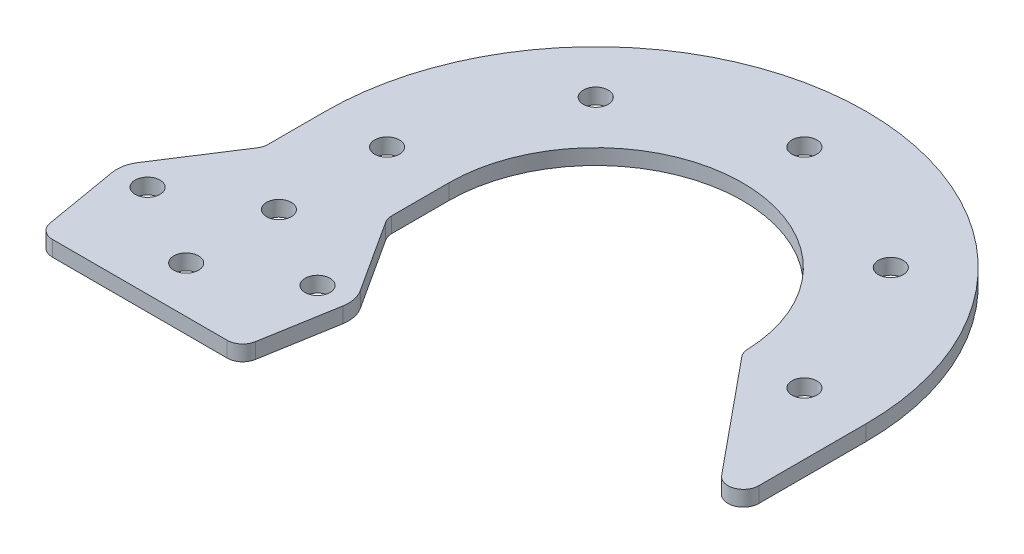
ISO-10303-21;
HEADER;
FILE_DESCRIPTION(('STEP AP214'),'2;1');
FILE_NAME('part.step','',(''),(''),'','','');
FILE_SCHEMA(('AUTOMOTIVE_DESIGN { 1 0 10303 214 1 1 1 1 }'));
ENDSEC;
DATA;
#1=APPLICATION_CONTEXT('core data for automotive mechanical design processes');
#2=APPLICATION_PROTOCOL_DEFINITION('international standard','automotive_design',2000,#1);
#3=PRODUCT_CONTEXT('',#1,'mechanical');
#4=PRODUCT('Part','Part','',(#3));
#5=PRODUCT_RELATED_PRODUCT_CATEGORY('part','',(#4));
#6=PRODUCT_DEFINITION_FORMATION('','',#4);
#7=PRODUCT_DEFINITION_CONTEXT('part definition',#1,'design');
#8=PRODUCT_DEFINITION('design','',#6,#7);
#9=PRODUCT_DEFINITION_SHAPE('','',#8);
#10=(LENGTH_UNIT() NAMED_UNIT(*) SI_UNIT(.MILLI.,.METRE.));
#11=(NAMED_UNIT(*) PLANE_ANGLE_UNIT() SI_UNIT($,.RADIAN.));
#12=(NAMED_UNIT(*) SI_UNIT($,.STERADIAN.) SOLID_ANGLE_UNIT());
#13=UNCERTAINTY_MEASURE_WITH_UNIT(LENGTH_MEASURE(1.E-05),#10,'distance_accuracy_value','');
#14=(GEOMETRIC_REPRESENTATION_CONTEXT(3) GLOBAL_UNCERTAINTY_ASSIGNED_CONTEXT((#13)) GLOBAL_UNIT_ASSIGNED_CONTEXT((#10,
#11,#12)) REPRESENTATION_CONTEXT('',''));
#15=CARTESIAN_POINT('',(0.,0.,0.));
#16=DIRECTION('',(0.,0.,1.));
#17=DIRECTION('',(1.,0.,0.));
#18=AXIS2_PLACEMENT_3D('',#15,#16,#17);
#19=CARTESIAN_POINT('',(88.8797617905169,3.175,-51.9614529831907));
#20=DIRECTION('',(0.,-1.,0.));
#21=DIRECTION('',(0.,0.,-1.));
#22=AXIS2_PLACEMENT_3D('',#19,#20,#21);
#23=CYLINDRICAL_SURFACE('',#22,3.175);
#24=CARTESIAN_POINT('',(88.8797617905169,3.175,-51.9614529831907));
#25=DIRECTION('',(0.,1.,0.));
#26=DIRECTION('',(0.,0.,1.));
#27=AXIS2_PLACEMENT_3D('',#24,#25,#26);
#28=CIRCLE('',#27,3.175);
#29=CARTESIAN_POINT('',(85.7066892390391,3.175,-51.8508384133629));
#30=VERTEX_POINT('',#29);
#31=CARTESIAN_POINT('',(86.4263326946628,3.175,-49.9461836037733));
#32=VERTEX_POINT('',#31);
#33=EDGE_CURVE('E308',#30,#32,#28,.T.);
#34=ORIENTED_EDGE('',*,*,#33,.F.);
#35=DIRECTION('',(0.,1.,0.));
#36=VECTOR('',#35,1.);
#37=CARTESIAN_POINT('',(85.7066892390391,3.175,-51.8508384133629));
#38=LINE('',#37,#36);
#39=CARTESIAN_POINT('',(85.7066892390391,0.,-51.8508384133629));
#40=VERTEX_POINT('',#39);
#41=EDGE_CURVE('E523',#40,#30,#38,.T.);
#42=ORIENTED_EDGE('',*,*,#41,.F.);
#43=CARTESIAN_POINT('',(88.8797617905169,0.,-51.9614529831907));
#44=DIRECTION('',(0.,-1.,0.));
#45=DIRECTION('',(0.,0.,1.));
#46=AXIS2_PLACEMENT_3D('',#43,#44,#45);
#47=CIRCLE('',#46,3.175);
#48=CARTESIAN_POINT('',(86.4263326946628,0.,-49.9461836037733));
#49=VERTEX_POINT('',#48);
#50=EDGE_CURVE('E425',#49,#40,#47,.T.);
#51=ORIENTED_EDGE('',*,*,#50,.F.);
#52=DIRECTION('',(0.,-1.,0.));
#53=VECTOR('',#52,1.);
#54=CARTESIAN_POINT('',(86.4263326946628,3.175,-49.9461836037733));
#55=LINE('',#54,#53);
#56=EDGE_CURVE('E451',#32,#49,#55,.T.);
#57=ORIENTED_EDGE('',*,*,#56,.F.);
#58=EDGE_LOOP('',(#34,#42,#51,#57));
#59=FACE_BOUND('',#58,.T.);
#60=ADVANCED_FACE('F17',(#59),#23,.T.);
#61=CARTESIAN_POINT('',(107.95,3.175,-28.7449650208988));
#62=DIRECTION('',(0.,-1.,0.));
#63=DIRECTION('',(0.,0.,-1.));
#64=AXIS2_PLACEMENT_3D('',#61,#62,#63);
#65=CYLINDRICAL_SURFACE('',#64,3.175);
#66=CARTESIAN_POINT('',(107.95,3.175,-28.7449650208988));
#67=DIRECTION('',(0.,1.,0.));
#68=DIRECTION('',(0.,0.,1.));
#69=AXIS2_PLACEMENT_3D('',#66,#67,#68);
#70=CIRCLE('',#69,3.175);
#71=CARTESIAN_POINT('',(105.496570904146,3.175,-26.7296956414817));
#72=VERTEX_POINT('',#71);
#73=CARTESIAN_POINT('',(111.125,3.175,-28.7449650208988));
#74=VERTEX_POINT('',#73);
#75=EDGE_CURVE('E307',#72,#74,#70,.T.);
#76=ORIENTED_EDGE('',*,*,#75,.F.);
#77=DIRECTION('',(0.,1.,0.));
#78=VECTOR('',#77,1.);
#79=CARTESIAN_POINT('',(105.496570904146,3.175,-26.7296956414817));
#80=LINE('',#79,#78);
#81=CARTESIAN_POINT('',(105.496570904146,0.,-26.7296956414817));
#82=VERTEX_POINT('',#81);
#83=EDGE_CURVE('E455',#82,#72,#80,.T.);
#84=ORIENTED_EDGE('',*,*,#83,.F.);
#85=CARTESIAN_POINT('',(107.95,0.,-28.7449650208988));
#86=DIRECTION('',(0.,-1.,0.));
#87=DIRECTION('',(0.,0.,1.));
#88=AXIS2_PLACEMENT_3D('',#85,#86,#87);
#89=CIRCLE('',#88,3.175);
#90=CARTESIAN_POINT('',(111.125,0.,-28.7449650208988));
#91=VERTEX_POINT('',#90);
#92=EDGE_CURVE('E331',#91,#82,#89,.T.);
#93=ORIENTED_EDGE('',*,*,#92,.F.);
#94=DIRECTION('',(0.,-1.,0.));
#95=VECTOR('',#94,1.);
#96=CARTESIAN_POINT('',(111.125,3.175,-28.7449650208988));
#97=LINE('',#96,#95);
#98=EDGE_CURVE('E454',#74,#91,#97,.T.);
#99=ORIENTED_EDGE('',*,*,#98,.F.);
#100=EDGE_LOOP('',(#76,#84,#93,#99));
#101=FACE_BOUND('',#100,.T.);
#102=ADVANCED_FACE('F19',(#101),#65,.T.);
#103=CARTESIAN_POINT('',(28.575,3.175,-39.037577783465));
#104=DIRECTION('',(0.,1.,0.));
#105=DIRECTION('',(0.,0.,1.));
#106=AXIS2_PLACEMENT_3D('',#103,#104,#105);
#107=CYLINDRICAL_SURFACE('',#106,3.175);
#108=CARTESIAN_POINT('',(28.575,3.175,-39.037577783465));
#109=DIRECTION('',(0.,-1.,0.));
#110=DIRECTION('',(0.,0.,1.));
#111=AXIS2_PLACEMENT_3D('',#108,#109,#110);
#112=CIRCLE('',#111,3.175);
#113=CARTESIAN_POINT('',(25.9093198261541,3.175,-37.3128244066703));
#114=VERTEX_POINT('',#113);
#115=CARTESIAN_POINT('',(25.4,3.175,-39.037577783465));
#116=VERTEX_POINT('',#115);
#117=EDGE_CURVE('E330',#114,#116,#112,.T.);
#118=ORIENTED_EDGE('',*,*,#117,.F.);
#119=DIRECTION('',(0.,1.,0.));
#120=VECTOR('',#119,1.);
#121=CARTESIAN_POINT('',(25.9093198261541,3.175,-37.3128244066703));
#122=LINE('',#121,#120);
#123=CARTESIAN_POINT('',(25.9093198261541,0.,-37.3128244066703));
#124=VERTEX_POINT('',#123);
#125=EDGE_CURVE('E415',#124,#114,#122,.T.);
#126=ORIENTED_EDGE('',*,*,#125,.F.);
#127=CARTESIAN_POINT('',(28.575,0.,-39.037577783465));
#128=DIRECTION('',(0.,1.,0.));
#129=DIRECTION('',(0.,0.,1.));
#130=AXIS2_PLACEMENT_3D('',#127,#128,#129);
#131=CIRCLE('',#130,3.175);
#132=CARTESIAN_POINT('',(25.4,0.,-39.037577783465));
#133=VERTEX_POINT('',#132);
#134=EDGE_CURVE('E488',#133,#124,#131,.T.);
#135=ORIENTED_EDGE('',*,*,#134,.F.);
#136=DIRECTION('',(0.,-1.,0.));
#137=VECTOR('',#136,1.);
#138=CARTESIAN_POINT('',(25.4,0.,-39.037577783465));
#139=LINE('',#138,#137);
#140=EDGE_CURVE('E411',#116,#133,#139,.T.);
#141=ORIENTED_EDGE('',*,*,#140,.F.);
#142=EDGE_LOOP('',(#118,#126,#135,#141));
#143=FACE_BOUND('',#142,.T.);
#144=ADVANCED_FACE('F584',(#143),#107,.F.);
#145=CARTESIAN_POINT('',(-3.175,3.175,-39.0375777834653));
#146=DIRECTION('',(0.,1.,0.));
#147=DIRECTION('',(0.,0.,1.));
#148=AXIS2_PLACEMENT_3D('',#145,#146,#147);
#149=CYLINDRICAL_SURFACE('',#148,3.175);
#150=CARTESIAN_POINT('',(-3.175,3.175,-39.0375777834653));
#151=DIRECTION('',(0.,-1.,0.));
#152=DIRECTION('',(0.,0.,1.));
#153=AXIS2_PLACEMENT_3D('',#150,#151,#152);
#154=CIRCLE('',#153,3.175);
#155=CARTESIAN_POINT('',(0.,3.175,-39.037577783465));
#156=VERTEX_POINT('',#155);
#157=CARTESIAN_POINT('',(-0.509319826154155,3.175,-37.3128244066705));
#158=VERTEX_POINT('',#157);
#159=EDGE_CURVE('E350',#156,#158,#154,.T.);
#160=ORIENTED_EDGE('',*,*,#159,.F.);
#161=DIRECTION('',(0.,1.,0.));
#162=VECTOR('',#161,1.);
#163=CARTESIAN_POINT('',(0.,3.175,-39.037577783465));
#164=LINE('',#163,#162);
#165=CARTESIAN_POINT('',(0.,0.,-39.037577783465));
#166=VERTEX_POINT('',#165);
#167=EDGE_CURVE('E381',#166,#156,#164,.T.);
#168=ORIENTED_EDGE('',*,*,#167,.F.);
#169=CARTESIAN_POINT('',(-3.175,0.,-39.0375777834653));
#170=DIRECTION('',(0.,1.,0.));
#171=DIRECTION('',(0.,0.,1.));
#172=AXIS2_PLACEMENT_3D('',#169,#170,#171);
#173=CIRCLE('',#172,3.175);
#174=CARTESIAN_POINT('',(-0.509319826154155,0.,-37.3128244066705));
#175=VERTEX_POINT('',#174);
#176=EDGE_CURVE('E355',#175,#166,#173,.T.);
#177=ORIENTED_EDGE('',*,*,#176,.F.);
#178=DIRECTION('',(0.,-1.,0.));
#179=VECTOR('',#178,1.);
#180=CARTESIAN_POINT('',(-0.509319826154155,0.,-37.3128244066705));
#181=LINE('',#180,#179);
#182=EDGE_CURVE('E384',#158,#175,#181,.T.);
#183=ORIENTED_EDGE('',*,*,#182,.F.);
#184=EDGE_LOOP('',(#160,#168,#177,#183));
#185=FACE_BOUND('',#184,.T.);
#186=ADVANCED_FACE('F542',(#185),#149,.F.);
#187=CARTESIAN_POINT('',(-5.26075169965521,3.175,-3.17500000000015));
#188=DIRECTION('',(0.,-1.,0.));
#189=DIRECTION('',(0.,0.,-1.));
#190=AXIS2_PLACEMENT_3D('',#187,#188,#189);
#191=CYLINDRICAL_SURFACE('',#190,3.175);
#192=CARTESIAN_POINT('',(-5.26075169965521,3.175,-3.17500000000015));
#193=DIRECTION('',(0.,1.,0.));
#194=DIRECTION('',(0.,0.,1.));
#195=AXIS2_PLACEMENT_3D('',#192,#193,#194);
#196=CIRCLE('',#195,3.175);
#197=CARTESIAN_POINT('',(-8.39004679199439,3.175,-2.63821584872325));
#198=VERTEX_POINT('',#197);
#199=CARTESIAN_POINT('',(-5.26075169965521,3.175,0.));
#200=VERTEX_POINT('',#199);
#201=EDGE_CURVE('E269',#198,#200,#196,.T.);
#202=ORIENTED_EDGE('',*,*,#201,.F.);
#203=DIRECTION('',(0.,1.,0.));
#204=VECTOR('',#203,1.);
#205=CARTESIAN_POINT('',(-8.39004679199439,3.175,-2.63821584872325));
#206=LINE('',#205,#204);
#207=CARTESIAN_POINT('',(-8.39004679199439,0.,-2.63821584872325));
#208=VERTEX_POINT('',#207);
#209=EDGE_CURVE('E11',#208,#198,#206,.T.);
#210=ORIENTED_EDGE('',*,*,#209,.F.);
#211=CARTESIAN_POINT('',(-5.26075169965521,0.,-3.17500000000015));
#212=DIRECTION('',(0.,-1.,0.));
#213=DIRECTION('',(0.,0.,1.));
#214=AXIS2_PLACEMENT_3D('',#211,#212,#213);
#215=CIRCLE('',#214,3.175);
#216=CARTESIAN_POINT('',(-5.26075169965521,0.,0.));
#217=VERTEX_POINT('',#216);
#218=EDGE_CURVE('E272',#217,#208,#215,.T.);
#219=ORIENTED_EDGE('',*,*,#218,.F.);
#220=DIRECTION('',(0.,-1.,0.));
#221=VECTOR('',#220,1.);
#222=CARTESIAN_POINT('',(-5.26075169965521,3.175,0.));
#223=LINE('',#222,#221);
#224=EDGE_CURVE('E266',#200,#217,#223,.T.);
#225=ORIENTED_EDGE('',*,*,#224,.F.);
#226=EDGE_LOOP('',(#202,#210,#219,#225));
#227=FACE_BOUND('',#226,.T.);
#228=ADVANCED_FACE('F268',(#227),#191,.T.);
#229=CARTESIAN_POINT('',(30.6607516996553,3.175,-3.17499999999993));
#230=DIRECTION('',(0.,-1.,0.));
#231=DIRECTION('',(0.,0.,-1.));
#232=AXIS2_PLACEMENT_3D('',#229,#230,#231);
#233=CYLINDRICAL_SURFACE('',#232,3.175);
#234=CARTESIAN_POINT('',(30.6607516996553,3.175,-3.17499999999993));
#235=DIRECTION('',(0.,1.,0.));
#236=DIRECTION('',(0.,0.,1.));
#237=AXIS2_PLACEMENT_3D('',#234,#235,#236);
#238=CIRCLE('',#237,3.175);
#239=CARTESIAN_POINT('',(30.6607516996553,3.175,0.));
#240=VERTEX_POINT('',#239);
#241=CARTESIAN_POINT('',(33.7900467919944,3.175,-2.63821584872303));
#242=VERTEX_POINT('',#241);
#243=EDGE_CURVE('E295',#240,#242,#238,.T.);
#244=ORIENTED_EDGE('',*,*,#243,.F.);
#245=DIRECTION('',(0.,1.,0.));
#246=VECTOR('',#245,1.);
#247=CARTESIAN_POINT('',(30.6607516996553,3.175,2.22044604925032E-13));
#248=LINE('',#247,#246);
#249=CARTESIAN_POINT('',(30.6607516996553,0.,0.));
#250=VERTEX_POINT('',#249);
#251=EDGE_CURVE('E279',#250,#240,#248,.T.);
#252=ORIENTED_EDGE('',*,*,#251,.F.);
#253=CARTESIAN_POINT('',(30.6607516996553,0.,-3.17499999999993));
#254=DIRECTION('',(0.,-1.,0.));
#255=DIRECTION('',(0.,0.,1.));
#256=AXIS2_PLACEMENT_3D('',#253,#254,#255);
#257=CIRCLE('',#256,3.175);
#258=CARTESIAN_POINT('',(33.7900467919944,0.,-2.63821584872303));
#259=VERTEX_POINT('',#258);
#260=EDGE_CURVE('E439',#259,#250,#257,.T.);
#261=ORIENTED_EDGE('',*,*,#260,.F.);
#262=DIRECTION('',(0.,-1.,0.));
#263=VECTOR('',#262,1.);
#264=CARTESIAN_POINT('',(33.7900467919944,3.175,-2.63821584872303));
#265=LINE('',#264,#263);
#266=EDGE_CURVE('E278',#242,#259,#265,.T.);
#267=ORIENTED_EDGE('',*,*,#266,.F.);
#268=EDGE_LOOP('',(#244,#252,#261,#267));
#269=FACE_BOUND('',#268,.T.);
#270=ADVANCED_FACE('F596',(#269),#233,.T.);
#271=CARTESIAN_POINT('',(12.7,3.175,-50.8));
#272=DIRECTION('',(0.,-1.,0.));
#273=DIRECTION('',(0.,0.,-1.));
#274=AXIS2_PLACEMENT_3D('',#271,#272,#273);
#275=CYLINDRICAL_SURFACE('',#274,2.5527);
#276=CARTESIAN_POINT('',(12.7,3.175,-50.8));
#277=DIRECTION('',(0.,1.,0.));
#278=DIRECTION('',(0.,0.,1.));
#279=AXIS2_PLACEMENT_3D('',#276,#277,#278);
#280=CIRCLE('',#279,2.5527);
#281=CARTESIAN_POINT('',(12.7,3.175,-48.2473));
#282=VERTEX_POINT('',#281);
#283=EDGE_CURVE('E428',#282,#282,#280,.T.);
#284=ORIENTED_EDGE('',*,*,#283,.T.);
#285=EDGE_LOOP('',(#284));
#286=FACE_BOUND('',#285,.T.);
#287=CARTESIAN_POINT('',(12.7,0.,-50.8));
#288=DIRECTION('',(0.,1.,0.));
#289=DIRECTION('',(0.,0.,1.));
#290=AXIS2_PLACEMENT_3D('',#287,#288,#289);
#291=CIRCLE('',#290,2.5527);
#292=CARTESIAN_POINT('',(12.7,0.,-48.2473));
#293=VERTEX_POINT('',#292);
#294=EDGE_CURVE('E38',#293,#293,#291,.T.);
#295=ORIENTED_EDGE('',*,*,#294,.F.);
#296=EDGE_LOOP('',(#295));
#297=FACE_BOUND('',#296,.T.);
#298=ADVANCED_FACE('F633',(#286,#297),#275,.F.);
#299=CARTESIAN_POINT('',(30.1625,3.175,-19.05));
#300=DIRECTION('',(0.,-1.,0.));
#301=DIRECTION('',(0.,0.,-1.));
#302=AXIS2_PLACEMENT_3D('',#299,#300,#301);
#303=CYLINDRICAL_SURFACE('',#302,2.5527);
#304=CARTESIAN_POINT('',(30.1625,3.175,-19.05));
#305=DIRECTION('',(0.,1.,0.));
#306=DIRECTION('',(0.,0.,-1.));
#307=AXIS2_PLACEMENT_3D('',#304,#305,#306);
#308=CIRCLE('',#307,2.5527);
#309=CARTESIAN_POINT('',(30.1625,3.175,-21.6027));
#310=VERTEX_POINT('',#309);
#311=EDGE_CURVE('E290',#310,#310,#308,.T.);
#312=ORIENTED_EDGE('',*,*,#311,.T.);
#313=EDGE_LOOP('',(#312));
#314=FACE_BOUND('',#313,.T.);
#315=CARTESIAN_POINT('',(30.1625,0.,-19.05));
#316=DIRECTION('',(0.,1.,0.));
#317=DIRECTION('',(0.,0.,-1.));
#318=AXIS2_PLACEMENT_3D('',#315,#316,#317);
#319=CIRCLE('',#318,2.5527);
#320=CARTESIAN_POINT('',(30.1625,0.,-21.6027));
#321=VERTEX_POINT('',#320);
#322=EDGE_CURVE('E46',#321,#321,#319,.T.);
#323=ORIENTED_EDGE('',*,*,#322,.F.);
#324=EDGE_LOOP('',(#323));
#325=FACE_BOUND('',#324,.T.);
#326=ADVANCED_FACE('F629',(#314,#325),#303,.F.);
#327=CARTESIAN_POINT('',(-4.7625,3.175,-19.05));
#328=DIRECTION('',(0.,-1.,0.));
#329=DIRECTION('',(0.,0.,-1.));
#330=AXIS2_PLACEMENT_3D('',#327,#328,#329);
#331=CYLINDRICAL_SURFACE('',#330,2.5527);
#332=CARTESIAN_POINT('',(-4.7625,3.175,-19.05));
#333=DIRECTION('',(0.,1.,0.));
#334=DIRECTION('',(0.,0.,1.));
#335=AXIS2_PLACEMENT_3D('',#332,#333,#334);
#336=CIRCLE('',#335,2.5527);
#337=CARTESIAN_POINT('',(-4.7625,3.175,-16.4973));
#338=VERTEX_POINT('',#337);
#339=EDGE_CURVE('E421',#338,#338,#336,.T.);
#340=ORIENTED_EDGE('',*,*,#339,.T.);
#341=EDGE_LOOP('',(#340));
#342=FACE_BOUND('',#341,.T.);
#343=CARTESIAN_POINT('',(-4.7625,0.,-19.05));
#344=DIRECTION('',(0.,1.,0.));
#345=DIRECTION('',(0.,0.,1.));
#346=AXIS2_PLACEMENT_3D('',#343,#344,#345);
#347=CIRCLE('',#346,2.5527);
#348=CARTESIAN_POINT('',(-4.7625,0.,-16.4973));
#349=VERTEX_POINT('',#348);
#350=EDGE_CURVE('E506',#349,#349,#347,.T.);
#351=ORIENTED_EDGE('',*,*,#350,.F.);
#352=EDGE_LOOP('',(#351));
#353=FACE_BOUND('',#352,.T.);
#354=ADVANCED_FACE('F625',(#342,#353),#331,.F.);
#355=CARTESIAN_POINT('',(25.2541355913915,3.175,-81.1083644086083));
#356=DIRECTION('',(0.,-1.,0.));
#357=DIRECTION('',(0.,0.,-1.));
#358=AXIS2_PLACEMENT_3D('',#355,#356,#357);
#359=CYLINDRICAL_SURFACE('',#358,2.55270000000004);
#360=CARTESIAN_POINT('',(25.2541355913915,3.175,-81.1083644086083));
#361=DIRECTION('',(0.,1.,0.));
#362=DIRECTION('',(0.,0.,1.));
#363=AXIS2_PLACEMENT_3D('',#360,#361,#362);
#364=CIRCLE('',#363,2.55270000000004);
#365=CARTESIAN_POINT('',(25.2541355913915,3.175,-78.5556644086083));
#366=VERTEX_POINT('',#365);
#367=EDGE_CURVE('E398',#366,#366,#364,.T.);
#368=ORIENTED_EDGE('',*,*,#367,.T.);
#369=EDGE_LOOP('',(#368));
#370=FACE_BOUND('',#369,.T.);
#371=CARTESIAN_POINT('',(25.2541355913915,0.,-81.1083644086083));
#372=DIRECTION('',(0.,1.,0.));
#373=DIRECTION('',(0.,0.,1.));
#374=AXIS2_PLACEMENT_3D('',#371,#372,#373);
#375=CIRCLE('',#374,2.55270000000004);
#376=CARTESIAN_POINT('',(25.2541355913915,0.,-78.5556644086083));
#377=VERTEX_POINT('',#376);
#378=EDGE_CURVE('E432',#377,#377,#375,.T.);
#379=ORIENTED_EDGE('',*,*,#378,.F.);
#380=EDGE_LOOP('',(#379));
#381=FACE_BOUND('',#380,.T.);
#382=ADVANCED_FACE('F621',(#370,#381),#359,.F.);
#383=CARTESIAN_POINT('',(55.5625,3.175,-93.6625));
#384=DIRECTION('',(0.,-1.,0.));
#385=DIRECTION('',(0.,0.,-1.));
#386=AXIS2_PLACEMENT_3D('',#383,#384,#385);
#387=CYLINDRICAL_SURFACE('',#386,2.5527);
#388=CARTESIAN_POINT('',(55.5625,3.175,-93.6625));
#389=DIRECTION('',(0.,1.,0.));
#390=DIRECTION('',(0.,0.,1.));
#391=AXIS2_PLACEMENT_3D('',#388,#389,#390);
#392=CIRCLE('',#391,2.5527);
#393=CARTESIAN_POINT('',(55.5625,3.175,-91.1098));
#394=VERTEX_POINT('',#393);
#395=EDGE_CURVE('E418',#394,#394,#392,.T.);
#396=ORIENTED_EDGE('',*,*,#395,.T.);
#397=EDGE_LOOP('',(#396));
#398=FACE_BOUND('',#397,.T.);
#399=CARTESIAN_POINT('',(55.5625,0.,-93.6625));
#400=DIRECTION('',(0.,1.,0.));
#401=DIRECTION('',(0.,0.,1.));
#402=AXIS2_PLACEMENT_3D('',#399,#400,#401);
#403=CIRCLE('',#402,2.5527);
#404=CARTESIAN_POINT('',(55.5625,0.,-91.1098));
#405=VERTEX_POINT('',#404);
#406=EDGE_CURVE('E429',#405,#405,#403,.T.);
#407=ORIENTED_EDGE('',*,*,#406,.F.);
#408=EDGE_LOOP('',(#407));
#409=FACE_BOUND('',#408,.T.);
#410=ADVANCED_FACE('F618',(#398,#409),#387,.F.);
#411=CARTESIAN_POINT('',(85.8708644086083,3.175,-81.1083644086081));
#412=DIRECTION('',(0.,-1.,0.));
#413=DIRECTION('',(0.,0.,-1.));
#414=AXIS2_PLACEMENT_3D('',#411,#412,#413);
#415=CYLINDRICAL_SURFACE('',#414,2.55270000000004);
#416=CARTESIAN_POINT('',(85.8708644086083,3.175,-81.1083644086081));
#417=DIRECTION('',(0.,1.,0.));
#418=DIRECTION('',(0.,0.,1.));
#419=AXIS2_PLACEMENT_3D('',#416,#417,#418);
#420=CIRCLE('',#419,2.55270000000004);
#421=CARTESIAN_POINT('',(85.8708644086083,3.175,-78.5556644086081));
#422=VERTEX_POINT('',#421);
#423=EDGE_CURVE('E401',#422,#422,#420,.T.);
#424=ORIENTED_EDGE('',*,*,#423,.T.);
#425=EDGE_LOOP('',(#424));
#426=FACE_BOUND('',#425,.T.);
#427=CARTESIAN_POINT('',(85.8708644086083,0.,-81.1083644086081));
#428=DIRECTION('',(0.,1.,0.));
#429=DIRECTION('',(0.,0.,1.));
#430=AXIS2_PLACEMENT_3D('',#427,#428,#429);
#431=CIRCLE('',#430,2.55270000000004);
#432=CARTESIAN_POINT('',(85.8708644086083,0.,-78.5556644086081));
#433=VERTEX_POINT('',#432);
#434=EDGE_CURVE('E321',#433,#433,#431,.T.);
#435=ORIENTED_EDGE('',*,*,#434,.F.);
#436=EDGE_LOOP('',(#435));
#437=FACE_BOUND('',#436,.T.);
#438=ADVANCED_FACE('F616',(#426,#437),#415,.F.);
#439=CARTESIAN_POINT('',(98.425,3.175,-50.8));
#440=DIRECTION('',(0.,-1.,0.));
#441=DIRECTION('',(0.,0.,-1.));
#442=AXIS2_PLACEMENT_3D('',#439,#440,#441);
#443=CYLINDRICAL_SURFACE('',#442,2.5527);
#444=CARTESIAN_POINT('',(98.425,3.175,-50.8));
#445=DIRECTION('',(0.,1.,0.));
#446=DIRECTION('',(0.,0.,1.));
#447=AXIS2_PLACEMENT_3D('',#444,#445,#446);
#448=CIRCLE('',#447,2.5527);
#449=CARTESIAN_POINT('',(98.425,3.175,-48.2473));
#450=VERTEX_POINT('',#449);
#451=EDGE_CURVE('E410',#450,#450,#448,.T.);
#452=ORIENTED_EDGE('',*,*,#451,.T.);
#453=EDGE_LOOP('',(#452));
#454=FACE_BOUND('',#453,.T.);
#455=CARTESIAN_POINT('',(98.425,0.,-50.8));
#456=DIRECTION('',(0.,1.,0.));
#457=DIRECTION('',(0.,0.,1.));
#458=AXIS2_PLACEMENT_3D('',#455,#456,#457);
#459=CIRCLE('',#458,2.5527);
#460=CARTESIAN_POINT('',(98.425,0.,-48.2473));
#461=VERTEX_POINT('',#460);
#462=EDGE_CURVE('E318',#461,#461,#459,.T.);
#463=ORIENTED_EDGE('',*,*,#462,.F.);
#464=EDGE_LOOP('',(#463));
#465=FACE_BOUND('',#464,.T.);
#466=ADVANCED_FACE('F700',(#454,#465),#443,.F.);
#467=CARTESIAN_POINT('',(12.7,3.175,-28.575));
#468=DIRECTION('',(0.,-1.,0.));
#469=DIRECTION('',(0.,0.,-1.));
#470=AXIS2_PLACEMENT_3D('',#467,#468,#469);
#471=CYLINDRICAL_SURFACE('',#470,2.5527);
#472=CARTESIAN_POINT('',(12.7,3.175,-28.575));
#473=DIRECTION('',(0.,1.,0.));
#474=DIRECTION('',(0.,0.,1.));
#475=AXIS2_PLACEMENT_3D('',#472,#473,#474);
#476=CIRCLE('',#475,2.5527);
#477=CARTESIAN_POINT('',(12.7,3.175,-26.0223));
#478=VERTEX_POINT('',#477);
#479=EDGE_CURVE('E404',#478,#478,#476,.T.);
#480=ORIENTED_EDGE('',*,*,#479,.T.);
#481=EDGE_LOOP('',(#480));
#482=FACE_BOUND('',#481,.T.);
#483=CARTESIAN_POINT('',(12.7,0.,-28.575));
#484=DIRECTION('',(0.,1.,0.));
#485=DIRECTION('',(0.,0.,1.));
#486=AXIS2_PLACEMENT_3D('',#483,#484,#485);
#487=CIRCLE('',#486,2.5527);
#488=CARTESIAN_POINT('',(12.7,0.,-26.0223));
#489=VERTEX_POINT('',#488);
#490=EDGE_CURVE('E322',#489,#489,#487,.T.);
#491=ORIENTED_EDGE('',*,*,#490,.F.);
#492=EDGE_LOOP('',(#491));
#493=FACE_BOUND('',#492,.T.);
#494=ADVANCED_FACE('F708',(#482,#493),#471,.F.);
#495=CARTESIAN_POINT('',(12.7,3.175,-9.525));
#496=DIRECTION('',(0.,-1.,0.));
#497=DIRECTION('',(0.,0.,-1.));
#498=AXIS2_PLACEMENT_3D('',#495,#496,#497);
#499=CYLINDRICAL_SURFACE('',#498,2.5527);
#500=CARTESIAN_POINT('',(12.7,3.175,-9.525));
#501=DIRECTION('',(0.,1.,0.));
#502=DIRECTION('',(0.,0.,1.));
#503=AXIS2_PLACEMENT_3D('',#500,#501,#502);
#504=CIRCLE('',#503,2.5527);
#505=CARTESIAN_POINT('',(12.7,3.175,-6.9723));
#506=VERTEX_POINT('',#505);
#507=EDGE_CURVE('E407',#506,#506,#504,.T.);
#508=ORIENTED_EDGE('',*,*,#507,.T.);
#509=EDGE_LOOP('',(#508));
#510=FACE_BOUND('',#509,.T.);
#511=CARTESIAN_POINT('',(12.7,0.,-9.525));
#512=DIRECTION('',(0.,1.,0.));
#513=DIRECTION('',(0.,0.,1.));
#514=AXIS2_PLACEMENT_3D('',#511,#512,#513);
#515=CIRCLE('',#514,2.5527);
#516=CARTESIAN_POINT('',(12.7,0.,-6.9723));
#517=VERTEX_POINT('',#516);
#518=EDGE_CURVE('E394',#517,#517,#515,.T.);
#519=ORIENTED_EDGE('',*,*,#518,.F.);
#520=EDGE_LOOP('',(#519));
#521=FACE_BOUND('',#520,.T.);
#522=ADVANCED_FACE('F717',(#510,#521),#499,.F.);
#523=CARTESIAN_POINT('',(-11.0210901846783,3.175,-17.9764316974465));
#524=DIRECTION('',(0.985604753492653,0.,-0.169065874417892));
#525=DIRECTION('',(0.,-1.,0.));
#526=AXIS2_PLACEMENT_3D('',#523,#524,#525);
#527=PLANE('',#526);
#528=DIRECTION('',(0.169065874417892,0.,0.985604753492653));
#529=VECTOR('',#528,1.);
#530=CARTESIAN_POINT('',(-11.0210901846783,0.,-17.9764316974465));
#531=LINE('',#530,#529);
#532=CARTESIAN_POINT('',(-11.0210901846783,0.,-17.9764316974465));
#533=VERTEX_POINT('',#532);
#534=EDGE_CURVE('E363',#533,#208,#531,.T.);
#535=ORIENTED_EDGE('',*,*,#534,.T.);
#536=ORIENTED_EDGE('',*,*,#209,.T.);
#537=DIRECTION('',(0.169065874417892,0.,0.985604753492653));
#538=VECTOR('',#537,1.);
#539=CARTESIAN_POINT('',(-11.0210901846783,3.175,-17.9764316974465));
#540=LINE('',#539,#538);
#541=CARTESIAN_POINT('',(-11.0210901846783,3.175,-17.9764316974465));
#542=VERTEX_POINT('',#541);
#543=EDGE_CURVE('E288',#542,#198,#540,.T.);
#544=ORIENTED_EDGE('',*,*,#543,.F.);
#545=DIRECTION('',(0.,-1.,0.));
#546=VECTOR('',#545,1.);
#547=CARTESIAN_POINT('',(-11.0210901846783,3.175,-17.9764316974465));
#548=LINE('',#547,#546);
#549=EDGE_CURVE('E21',#542,#533,#548,.T.);
#550=ORIENTED_EDGE('',*,*,#549,.T.);
#551=EDGE_LOOP('',(#535,#536,#544,#550));
#552=FACE_BOUND('',#551,.T.);
#553=ADVANCED_FACE('F725',(#552),#527,.F.);
#554=CARTESIAN_POINT('',(-4.7625,3.175,-19.05));
#555=DIRECTION('',(0.,-1.,0.));
#556=DIRECTION('',(0.,0.,-1.));
#557=AXIS2_PLACEMENT_3D('',#554,#555,#556);
#558=CYLINDRICAL_SURFACE('',#557,6.35);
#559=CARTESIAN_POINT('',(-4.7625,0.,-19.05));
#560=DIRECTION('',(0.,1.,0.));
#561=DIRECTION('',(0.,0.,1.));
#562=AXIS2_PLACEMENT_3D('',#559,#560,#561);
#563=CIRCLE('',#562,6.35);
#564=CARTESIAN_POINT('',(-10.0938603476917,0.,-22.4995067535896));
#565=VERTEX_POINT('',#564);
#566=EDGE_CURVE('E356',#565,#533,#563,.T.);
#567=ORIENTED_EDGE('',*,*,#566,.T.);
#568=ORIENTED_EDGE('',*,*,#549,.F.);
#569=CARTESIAN_POINT('',(-4.7625,3.175,-19.05));
#570=DIRECTION('',(0.,1.,0.));
#571=DIRECTION('',(0.,0.,1.));
#572=AXIS2_PLACEMENT_3D('',#569,#570,#571);
#573=CIRCLE('',#572,6.35);
#574=CARTESIAN_POINT('',(-10.0938603476917,3.175,-22.4995067535896));
#575=VERTEX_POINT('',#574);
#576=EDGE_CURVE('E349',#575,#542,#573,.T.);
#577=ORIENTED_EDGE('',*,*,#576,.F.);
#578=DIRECTION('',(0.,-1.,0.));
#579=VECTOR('',#578,1.);
#580=CARTESIAN_POINT('',(-10.0938603476917,3.175,-22.4995067535896));
#581=LINE('',#580,#579);
#582=EDGE_CURVE('E440',#575,#565,#581,.T.);
#583=ORIENTED_EDGE('',*,*,#582,.T.);
#584=EDGE_LOOP('',(#567,#568,#577,#583));
#585=FACE_BOUND('',#584,.T.);
#586=ADVANCED_FACE('F549',(#585),#558,.T.);
#587=CARTESIAN_POINT('',(-10.0938603476917,3.175,-22.4995067535896));
#588=DIRECTION('',(0.839584306723108,0.,0.54322941001411));
#589=DIRECTION('',(0.,-1.,0.));
#590=AXIS2_PLACEMENT_3D('',#587,#588,#589);
#591=PLANE('',#590);
#592=DIRECTION('',(-0.54322941001411,0.,0.839584306723108));
#593=VECTOR('',#592,1.);
#594=CARTESIAN_POINT('',(-10.0938603476917,3.175,-22.4995067535896));
#595=LINE('',#594,#593);
#596=EDGE_CURVE('E345',#158,#575,#595,.T.);
#597=ORIENTED_EDGE('',*,*,#596,.F.);
#598=ORIENTED_EDGE('',*,*,#182,.T.);
#599=DIRECTION('',(-0.54322941001411,0.,0.839584306723108));
#600=VECTOR('',#599,1.);
#601=CARTESIAN_POINT('',(-10.0938603476917,0.,-22.4995067535896));
#602=LINE('',#601,#600);
#603=EDGE_CURVE('E351',#175,#565,#602,.T.);
#604=ORIENTED_EDGE('',*,*,#603,.T.);
#605=ORIENTED_EDGE('',*,*,#582,.F.);
#606=EDGE_LOOP('',(#597,#598,#604,#605));
#607=FACE_BOUND('',#606,.T.);
#608=ADVANCED_FACE('F537',(#607),#591,.F.);
#609=CARTESIAN_POINT('',(0.,3.175,-38.1));
#610=DIRECTION('',(1.,0.,0.));
#611=DIRECTION('',(0.,0.,-1.));
#612=AXIS2_PLACEMENT_3D('',#609,#610,#611);
#613=PLANE('',#612);
#614=DIRECTION('',(0.,0.,1.));
#615=VECTOR('',#614,1.);
#616=CARTESIAN_POINT('',(0.,0.,-38.1));
#617=LINE('',#616,#615);
#618=CARTESIAN_POINT('',(0.,0.,-50.8));
#619=VERTEX_POINT('',#618);
#620=EDGE_CURVE('E466',#619,#166,#617,.T.);
#621=ORIENTED_EDGE('',*,*,#620,.T.);
#622=ORIENTED_EDGE('',*,*,#167,.T.);
#623=DIRECTION('',(0.,0.,1.));
#624=VECTOR('',#623,1.);
#625=CARTESIAN_POINT('',(0.,3.175,-38.1));
#626=LINE('',#625,#624);
#627=CARTESIAN_POINT('',(0.,3.175,-50.8));
#628=VERTEX_POINT('',#627);
#629=EDGE_CURVE('E371',#628,#156,#626,.T.);
#630=ORIENTED_EDGE('',*,*,#629,.F.);
#631=DIRECTION('',(0.,-1.,0.));
#632=VECTOR('',#631,1.);
#633=CARTESIAN_POINT('',(0.,3.175,-50.8));
#634=LINE('',#633,#632);
#635=EDGE_CURVE('E385',#628,#619,#634,.T.);
#636=ORIENTED_EDGE('',*,*,#635,.T.);
#637=EDGE_LOOP('',(#621,#622,#630,#636));
#638=FACE_BOUND('',#637,.T.);
#639=ADVANCED_FACE('F554',(#638),#613,.F.);
#640=CARTESIAN_POINT('',(55.5625,3.175,-50.8));
#641=DIRECTION('',(0.,-1.,0.));
#642=DIRECTION('',(0.,0.,-1.));
#643=AXIS2_PLACEMENT_3D('',#640,#641,#642);
#644=CYLINDRICAL_SURFACE('',#643,55.5625);
#645=CARTESIAN_POINT('',(55.5625,0.,-50.8));
#646=DIRECTION('',(0.,1.,0.));
#647=DIRECTION('',(0.,0.,1.));
#648=AXIS2_PLACEMENT_3D('',#645,#646,#647);
#649=CIRCLE('',#648,55.5625);
#650=CARTESIAN_POINT('',(111.125,0.,-50.8));
#651=VERTEX_POINT('',#650);
#652=EDGE_CURVE('E470',#651,#619,#649,.T.);
#653=ORIENTED_EDGE('',*,*,#652,.T.);
#654=ORIENTED_EDGE('',*,*,#635,.F.);
#655=CARTESIAN_POINT('',(55.5625,3.175,-50.8));
#656=DIRECTION('',(0.,1.,0.));
#657=DIRECTION('',(0.,0.,1.));
#658=AXIS2_PLACEMENT_3D('',#655,#656,#657);
#659=CIRCLE('',#658,55.5625);
#660=CARTESIAN_POINT('',(111.125,3.175,-50.8));
#661=VERTEX_POINT('',#660);
#662=EDGE_CURVE('E367',#661,#628,#659,.T.);
#663=ORIENTED_EDGE('',*,*,#662,.F.);
#664=DIRECTION('',(0.,-1.,0.));
#665=VECTOR('',#664,1.);
#666=CARTESIAN_POINT('',(111.125,3.175,-50.8));
#667=LINE('',#666,#665);
#668=EDGE_CURVE('E501',#661,#651,#667,.T.);
#669=ORIENTED_EDGE('',*,*,#668,.T.);
#670=EDGE_LOOP('',(#653,#654,#663,#669));
#671=FACE_BOUND('',#670,.T.);
#672=ADVANCED_FACE('F558',(#671),#644,.T.);
#673=CARTESIAN_POINT('',(111.125,3.175,-50.8));
#674=DIRECTION('',(-1.,0.,0.));
#675=DIRECTION('',(0.,1.,0.));
#676=AXIS2_PLACEMENT_3D('',#673,#674,#675);
#677=PLANE('',#676);
#678=DIRECTION('',(0.,0.,-1.));
#679=VECTOR('',#678,1.);
#680=CARTESIAN_POINT('',(111.125,3.175,-50.8));
#681=LINE('',#680,#679);
#682=EDGE_CURVE('E340',#74,#661,#681,.T.);
#683=ORIENTED_EDGE('',*,*,#682,.F.);
#684=ORIENTED_EDGE('',*,*,#98,.T.);
#685=DIRECTION('',(0.,0.,-1.));
#686=VECTOR('',#685,1.);
#687=CARTESIAN_POINT('',(111.125,0.,-50.8));
#688=LINE('',#687,#686);
#689=EDGE_CURVE('E336',#91,#651,#688,.T.);
#690=ORIENTED_EDGE('',*,*,#689,.T.);
#691=ORIENTED_EDGE('',*,*,#668,.F.);
#692=EDGE_LOOP('',(#683,#684,#690,#691));
#693=FACE_BOUND('',#692,.T.);
#694=ADVANCED_FACE('F561',(#693),#677,.F.);
#695=CARTESIAN_POINT('',(111.125,3.175,-19.8775339162269));
#696=DIRECTION('',(0.772733573497354,0.,-0.634730513202264));
#697=DIRECTION('',(0.,-1.,0.));
#698=AXIS2_PLACEMENT_3D('',#695,#696,#697);
#699=PLANE('',#698);
#700=DIRECTION('',(0.634730513202264,0.,0.772733573497354));
#701=VECTOR('',#700,1.);
#702=CARTESIAN_POINT('',(111.125,0.,-19.8775339162269));
#703=LINE('',#702,#701);
#704=EDGE_CURVE('E335',#49,#82,#703,.T.);
#705=ORIENTED_EDGE('',*,*,#704,.T.);
#706=ORIENTED_EDGE('',*,*,#83,.T.);
#707=DIRECTION('',(0.634730513202264,0.,0.772733573497354));
#708=VECTOR('',#707,1.);
#709=CARTESIAN_POINT('',(111.125,3.175,-19.8775339162269));
#710=LINE('',#709,#708);
#711=EDGE_CURVE('E304',#32,#72,#710,.T.);
#712=ORIENTED_EDGE('',*,*,#711,.F.);
#713=ORIENTED_EDGE('',*,*,#56,.T.);
#714=EDGE_LOOP('',(#705,#706,#712,#713));
#715=FACE_BOUND('',#714,.T.);
#716=ADVANCED_FACE('F569',(#715),#699,.F.);
#717=CARTESIAN_POINT('',(55.5625,3.175,-50.8));
#718=DIRECTION('',(0.,-1.,0.));
#719=DIRECTION('',(0.,0.,-1.));
#720=AXIS2_PLACEMENT_3D('',#717,#718,#719);
#721=CYLINDRICAL_SURFACE('',#720,30.1625);
#722=CARTESIAN_POINT('',(55.5625,0.,-50.8));
#723=DIRECTION('',(0.,-1.,0.));
#724=DIRECTION('',(0.,0.,1.));
#725=AXIS2_PLACEMENT_3D('',#722,#723,#724);
#726=CIRCLE('',#725,30.1625);
#727=CARTESIAN_POINT('',(25.4,0.,-50.8));
#728=VERTEX_POINT('',#727);
#729=EDGE_CURVE('E462',#728,#40,#726,.T.);
#730=ORIENTED_EDGE('',*,*,#729,.T.);
#731=ORIENTED_EDGE('',*,*,#41,.T.);
#732=CARTESIAN_POINT('',(55.5625,3.175,-50.8));
#733=DIRECTION('',(0.,-1.,0.));
#734=DIRECTION('',(0.,0.,1.));
#735=AXIS2_PLACEMENT_3D('',#732,#733,#734);
#736=CIRCLE('',#735,30.1625);
#737=CARTESIAN_POINT('',(25.4,3.175,-50.8));
#738=VERTEX_POINT('',#737);
#739=EDGE_CURVE('E313',#738,#30,#736,.T.);
#740=ORIENTED_EDGE('',*,*,#739,.F.);
#741=DIRECTION('',(0.,-1.,0.));
#742=VECTOR('',#741,1.);
#743=CARTESIAN_POINT('',(25.4,3.175,-50.8));
#744=LINE('',#743,#742);
#745=EDGE_CURVE('E414',#738,#728,#744,.T.);
#746=ORIENTED_EDGE('',*,*,#745,.T.);
#747=EDGE_LOOP('',(#730,#731,#740,#746));
#748=FACE_BOUND('',#747,.T.);
#749=ADVANCED_FACE('F575',(#748),#721,.F.);
#750=CARTESIAN_POINT('',(25.4,3.175,-38.1));
#751=DIRECTION('',(-1.,0.,0.));
#752=DIRECTION('',(0.,1.,0.));
#753=AXIS2_PLACEMENT_3D('',#750,#751,#752);
#754=PLANE('',#753);
#755=DIRECTION('',(0.,0.,-1.));
#756=VECTOR('',#755,1.);
#757=CARTESIAN_POINT('',(25.4,3.175,-38.1));
#758=LINE('',#757,#756);
#759=EDGE_CURVE('E344',#116,#738,#758,.T.);
#760=ORIENTED_EDGE('',*,*,#759,.F.);
#761=ORIENTED_EDGE('',*,*,#140,.T.);
#762=DIRECTION('',(0.,0.,-1.));
#763=VECTOR('',#762,1.);
#764=CARTESIAN_POINT('',(25.4,0.,-38.1));
#765=LINE('',#764,#763);
#766=EDGE_CURVE('E484',#133,#728,#765,.T.);
#767=ORIENTED_EDGE('',*,*,#766,.T.);
#768=ORIENTED_EDGE('',*,*,#745,.F.);
#769=EDGE_LOOP('',(#760,#761,#767,#768));
#770=FACE_BOUND('',#769,.T.);
#771=ADVANCED_FACE('F581',(#770),#754,.F.);
#772=CARTESIAN_POINT('',(35.4938603476918,3.175,-22.4995067535896));
#773=DIRECTION('',(-0.839584306723108,0.,0.543229410014111));
#774=DIRECTION('',(0.,1.,0.));
#775=AXIS2_PLACEMENT_3D('',#772,#773,#774);
#776=PLANE('',#775);
#777=DIRECTION('',(-0.543229410014111,0.,-0.839584306723108));
#778=VECTOR('',#777,1.);
#779=CARTESIAN_POINT('',(35.4938603476918,0.,-22.4995067535896));
#780=LINE('',#779,#778);
#781=CARTESIAN_POINT('',(35.4938603476918,0.,-22.4995067535896));
#782=VERTEX_POINT('',#781);
#783=EDGE_CURVE('E395',#782,#124,#780,.T.);
#784=ORIENTED_EDGE('',*,*,#783,.T.);
#785=ORIENTED_EDGE('',*,*,#125,.T.);
#786=DIRECTION('',(-0.543229410014111,0.,-0.839584306723108));
#787=VECTOR('',#786,1.);
#788=CARTESIAN_POINT('',(35.4938603476918,3.175,-22.4995067535896));
#789=LINE('',#788,#787);
#790=CARTESIAN_POINT('',(35.4938603476918,3.175,-22.4995067535896));
#791=VERTEX_POINT('',#790);
#792=EDGE_CURVE('E326',#791,#114,#789,.T.);
#793=ORIENTED_EDGE('',*,*,#792,.F.);
#794=DIRECTION('',(0.,-1.,0.));
#795=VECTOR('',#794,1.);
#796=CARTESIAN_POINT('',(35.4938603476918,3.175,-22.4995067535896));
#797=LINE('',#796,#795);
#798=EDGE_CURVE('E474',#791,#782,#797,.T.);
#799=ORIENTED_EDGE('',*,*,#798,.T.);
#800=EDGE_LOOP('',(#784,#785,#793,#799));
#801=FACE_BOUND('',#800,.T.);
#802=ADVANCED_FACE('F587',(#801),#776,.F.);
#803=CARTESIAN_POINT('',(30.1625,3.175,-19.05));
#804=DIRECTION('',(0.,-1.,0.));
#805=DIRECTION('',(0.,0.,-1.));
#806=AXIS2_PLACEMENT_3D('',#803,#804,#805);
#807=CYLINDRICAL_SURFACE('',#806,6.35);
#808=CARTESIAN_POINT('',(30.1625,0.,-19.05));
#809=DIRECTION('',(0.,1.,0.));
#810=DIRECTION('',(0.,0.,-1.));
#811=AXIS2_PLACEMENT_3D('',#808,#809,#810);
#812=CIRCLE('',#811,6.35);
#813=CARTESIAN_POINT('',(36.4210901846783,0.,-17.9764316974462));
#814=VERTEX_POINT('',#813);
#815=EDGE_CURVE('E390',#814,#782,#812,.T.);
#816=ORIENTED_EDGE('',*,*,#815,.T.);
#817=ORIENTED_EDGE('',*,*,#798,.F.);
#818=CARTESIAN_POINT('',(30.1625,3.175,-19.05));
#819=DIRECTION('',(0.,1.,0.));
#820=DIRECTION('',(0.,0.,-1.));
#821=AXIS2_PLACEMENT_3D('',#818,#819,#820);
#822=CIRCLE('',#821,6.35);
#823=CARTESIAN_POINT('',(36.4210901846783,3.175,-17.9764316974462));
#824=VERTEX_POINT('',#823);
#825=EDGE_CURVE('E317',#824,#791,#822,.T.);
#826=ORIENTED_EDGE('',*,*,#825,.F.);
#827=DIRECTION('',(0.,-1.,0.));
#828=VECTOR('',#827,1.);
#829=CARTESIAN_POINT('',(36.4210901846783,3.175,-17.9764316974462));
#830=LINE('',#829,#828);
#831=EDGE_CURVE('E477',#824,#814,#830,.T.);
#832=ORIENTED_EDGE('',*,*,#831,.T.);
#833=EDGE_LOOP('',(#816,#817,#826,#832));
#834=FACE_BOUND('',#833,.T.);
#835=ADVANCED_FACE('F597',(#834),#807,.T.);
#836=CARTESIAN_POINT('',(36.4210901846783,3.175,-17.9764316974462));
#837=DIRECTION('',(-0.985604753492653,0.,-0.169065874417891));
#838=DIRECTION('',(-0.169065874417891,0.,0.985604753492653));
#839=AXIS2_PLACEMENT_3D('',#836,#837,#838);
#840=PLANE('',#839);
#841=DIRECTION('',(0.169065874417891,0.,-0.985604753492653));
#842=VECTOR('',#841,1.);
#843=CARTESIAN_POINT('',(36.4210901846783,3.175,-17.9764316974462));
#844=LINE('',#843,#842);
#845=EDGE_CURVE('E301',#242,#824,#844,.T.);
#846=ORIENTED_EDGE('',*,*,#845,.F.);
#847=ORIENTED_EDGE('',*,*,#266,.T.);
#848=DIRECTION('',(0.169065874417891,0.,-0.985604753492653));
#849=VECTOR('',#848,1.);
#850=CARTESIAN_POINT('',(36.4210901846783,0.,-17.9764316974462));
#851=LINE('',#850,#849);
#852=EDGE_CURVE('E435',#259,#814,#851,.T.);
#853=ORIENTED_EDGE('',*,*,#852,.T.);
#854=ORIENTED_EDGE('',*,*,#831,.F.);
#855=EDGE_LOOP('',(#846,#847,#853,#854));
#856=FACE_BOUND('',#855,.T.);
#857=ADVANCED_FACE('F592',(#856),#840,.F.);
#858=CARTESIAN_POINT('',(25.4,3.175,0.));
#859=DIRECTION('',(0.,0.,-1.));
#860=DIRECTION('',(0.,-1.,0.));
#861=AXIS2_PLACEMENT_3D('',#858,#859,#860);
#862=PLANE('',#861);
#863=DIRECTION('',(1.,0.,0.));
#864=VECTOR('',#863,1.);
#865=CARTESIAN_POINT('',(25.4,0.,0.));
#866=LINE('',#865,#864);
#867=EDGE_CURVE('E446',#217,#250,#866,.T.);
#868=ORIENTED_EDGE('',*,*,#867,.T.);
#869=ORIENTED_EDGE('',*,*,#251,.T.);
#870=DIRECTION('',(1.,0.,0.));
#871=VECTOR('',#870,1.);
#872=CARTESIAN_POINT('',(0.,3.175,0.));
#873=LINE('',#872,#871);
#874=EDGE_CURVE('E285',#200,#240,#873,.T.);
#875=ORIENTED_EDGE('',*,*,#874,.F.);
#876=ORIENTED_EDGE('',*,*,#224,.T.);
#877=EDGE_LOOP('',(#868,#869,#875,#876));
#878=FACE_BOUND('',#877,.T.);
#879=ADVANCED_FACE('F292',(#878),#862,.F.);
#880=CARTESIAN_POINT('',(-4.7625,0.,-19.05));
#881=DIRECTION('',(0.,1.,0.));
#882=DIRECTION('',(1.,0.,0.));
#883=AXIS2_PLACEMENT_3D('',#880,#881,#882);
#884=PLANE('',#883);
#885=ORIENTED_EDGE('',*,*,#294,.T.);
#886=EDGE_LOOP('',(#885));
#887=FACE_BOUND('',#886,.T.);
#888=ORIENTED_EDGE('',*,*,#322,.T.);
#889=EDGE_LOOP('',(#888));
#890=FACE_BOUND('',#889,.T.);
#891=ORIENTED_EDGE('',*,*,#350,.T.);
#892=EDGE_LOOP('',(#891));
#893=FACE_BOUND('',#892,.T.);
#894=ORIENTED_EDGE('',*,*,#378,.T.);
#895=EDGE_LOOP('',(#894));
#896=FACE_BOUND('',#895,.T.);
#897=ORIENTED_EDGE('',*,*,#406,.T.);
#898=EDGE_LOOP('',(#897));
#899=FACE_BOUND('',#898,.T.);
#900=ORIENTED_EDGE('',*,*,#434,.T.);
#901=EDGE_LOOP('',(#900));
#902=FACE_BOUND('',#901,.T.);
#903=ORIENTED_EDGE('',*,*,#462,.T.);
#904=EDGE_LOOP('',(#903));
#905=FACE_BOUND('',#904,.T.);
#906=ORIENTED_EDGE('',*,*,#490,.T.);
#907=EDGE_LOOP('',(#906));
#908=FACE_BOUND('',#907,.T.);
#909=ORIENTED_EDGE('',*,*,#518,.T.);
#910=EDGE_LOOP('',(#909));
#911=FACE_BOUND('',#910,.T.);
#912=ORIENTED_EDGE('',*,*,#852,.F.);
#913=ORIENTED_EDGE('',*,*,#260,.T.);
#914=ORIENTED_EDGE('',*,*,#867,.F.);
#915=ORIENTED_EDGE('',*,*,#218,.T.);
#916=ORIENTED_EDGE('',*,*,#534,.F.);
#917=ORIENTED_EDGE('',*,*,#566,.F.);
#918=ORIENTED_EDGE('',*,*,#603,.F.);
#919=ORIENTED_EDGE('',*,*,#176,.T.);
#920=ORIENTED_EDGE('',*,*,#620,.F.);
#921=ORIENTED_EDGE('',*,*,#652,.F.);
#922=ORIENTED_EDGE('',*,*,#689,.F.);
#923=ORIENTED_EDGE('',*,*,#92,.T.);
#924=ORIENTED_EDGE('',*,*,#704,.F.);
#925=ORIENTED_EDGE('',*,*,#50,.T.);
#926=ORIENTED_EDGE('',*,*,#729,.F.);
#927=ORIENTED_EDGE('',*,*,#766,.F.);
#928=ORIENTED_EDGE('',*,*,#134,.T.);
#929=ORIENTED_EDGE('',*,*,#783,.F.);
#930=ORIENTED_EDGE('',*,*,#815,.F.);
#931=EDGE_LOOP('',(#912,#913,#914,#915,#916,#917,#918,#919,#920,#921,#922,#923,#924,#925,#926,
#927,#928,#929,#930));
#932=FACE_BOUND('',#931,.T.);
#933=ADVANCED_FACE('F546',(#887,#890,#893,#896,#899,#902,#905,#908,#911,#932),#884,.F.);
#934=CARTESIAN_POINT('',(-4.7625,3.175,-19.05));
#935=DIRECTION('',(0.,1.,0.));
#936=DIRECTION('',(1.,0.,0.));
#937=AXIS2_PLACEMENT_3D('',#934,#935,#936);
#938=PLANE('',#937);
#939=ORIENTED_EDGE('',*,*,#283,.F.);
#940=EDGE_LOOP('',(#939));
#941=FACE_BOUND('',#940,.T.);
#942=ORIENTED_EDGE('',*,*,#339,.F.);
#943=EDGE_LOOP('',(#942));
#944=FACE_BOUND('',#943,.T.);
#945=ORIENTED_EDGE('',*,*,#395,.F.);
#946=EDGE_LOOP('',(#945));
#947=FACE_BOUND('',#946,.T.);
#948=ORIENTED_EDGE('',*,*,#451,.F.);
#949=EDGE_LOOP('',(#948));
#950=FACE_BOUND('',#949,.T.);
#951=ORIENTED_EDGE('',*,*,#507,.F.);
#952=EDGE_LOOP('',(#951));
#953=FACE_BOUND('',#952,.T.);
#954=ORIENTED_EDGE('',*,*,#479,.F.);
#955=EDGE_LOOP('',(#954));
#956=FACE_BOUND('',#955,.T.);
#957=ORIENTED_EDGE('',*,*,#423,.F.);
#958=EDGE_LOOP('',(#957));
#959=FACE_BOUND('',#958,.T.);
#960=ORIENTED_EDGE('',*,*,#367,.F.);
#961=EDGE_LOOP('',(#960));
#962=FACE_BOUND('',#961,.T.);
#963=ORIENTED_EDGE('',*,*,#311,.F.);
#964=EDGE_LOOP('',(#963));
#965=FACE_BOUND('',#964,.T.);
#966=ORIENTED_EDGE('',*,*,#874,.T.);
#967=ORIENTED_EDGE('',*,*,#243,.T.);
#968=ORIENTED_EDGE('',*,*,#845,.T.);
#969=ORIENTED_EDGE('',*,*,#825,.T.);
#970=ORIENTED_EDGE('',*,*,#792,.T.);
#971=ORIENTED_EDGE('',*,*,#117,.T.);
#972=ORIENTED_EDGE('',*,*,#759,.T.);
#973=ORIENTED_EDGE('',*,*,#739,.T.);
#974=ORIENTED_EDGE('',*,*,#33,.T.);
#975=ORIENTED_EDGE('',*,*,#711,.T.);
#976=ORIENTED_EDGE('',*,*,#75,.T.);
#977=ORIENTED_EDGE('',*,*,#682,.T.);
#978=ORIENTED_EDGE('',*,*,#662,.T.);
#979=ORIENTED_EDGE('',*,*,#629,.T.);
#980=ORIENTED_EDGE('',*,*,#159,.T.);
#981=ORIENTED_EDGE('',*,*,#596,.T.);
#982=ORIENTED_EDGE('',*,*,#576,.T.);
#983=ORIENTED_EDGE('',*,*,#543,.T.);
#984=ORIENTED_EDGE('',*,*,#201,.T.);
#985=EDGE_LOOP('',(#966,#967,#968,#969,#970,#971,#972,#973,#974,#975,#976,#977,#978,#979,#980,
#981,#982,#983,#984));
#986=FACE_BOUND('',#985,.T.);
#987=ADVANCED_FACE('F283',(#941,#944,#947,#950,#953,#956,#959,#962,#965,#986),#938,.T.);
#988=CLOSED_SHELL('',(#60,#102,#144,#186,#228,#270,#298,#326,#354,#382,#410,#438,#466,#494,#522,
#553,#586,#608,#639,#672,#694,#716,#749,#771,#802,#835,#857,#879,#933,#987));
#989=MANIFOLD_SOLID_BREP('B1',#988);
#990=ADVANCED_BREP_SHAPE_REPRESENTATION('',(#18,#989),#14);
#991=SHAPE_DEFINITION_REPRESENTATION(#9,#990);
ENDSEC;
END-ISO-10303-21;
